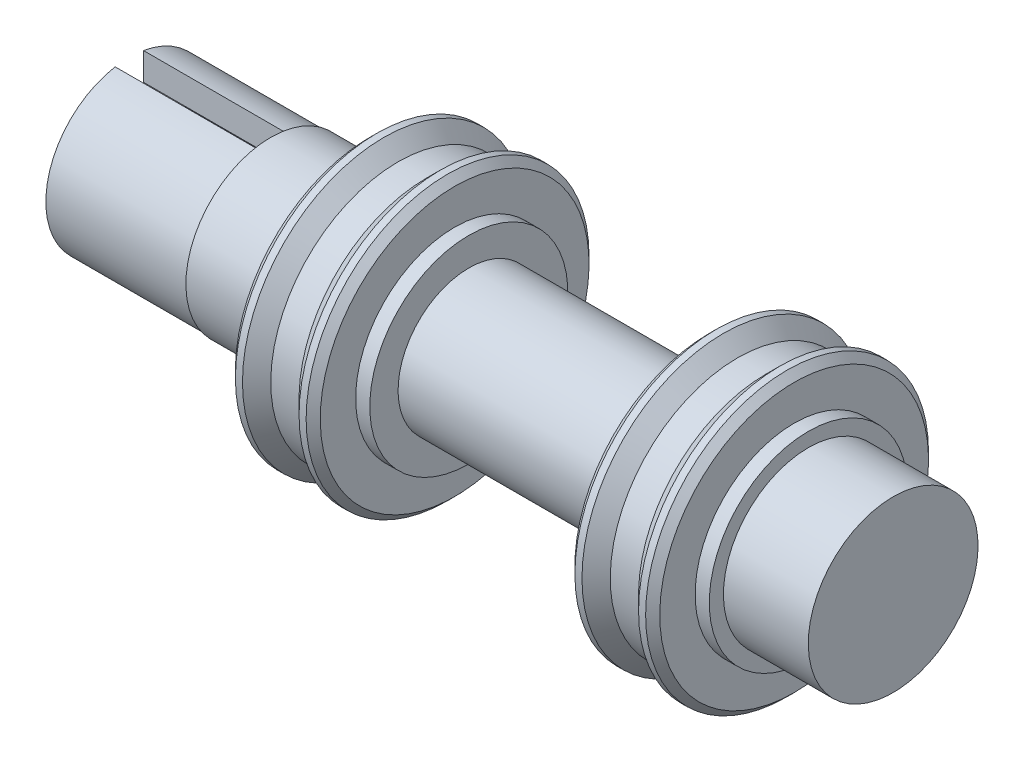
ISO-10303-21;
HEADER;
FILE_DESCRIPTION(('STEP AP214'),'2;1');
FILE_NAME('part.step','',(''),(''),'','','');
FILE_SCHEMA(('AUTOMOTIVE_DESIGN { 1 0 10303 214 1 1 1 1 }'));
ENDSEC;
DATA;
#1=APPLICATION_CONTEXT('core data for automotive mechanical design processes');
#2=APPLICATION_PROTOCOL_DEFINITION('international standard','automotive_design',2000,#1);
#3=PRODUCT_CONTEXT('',#1,'mechanical');
#4=PRODUCT('Part','Part','',(#3));
#5=PRODUCT_RELATED_PRODUCT_CATEGORY('part','',(#4));
#6=PRODUCT_DEFINITION_FORMATION('','',#4);
#7=PRODUCT_DEFINITION_CONTEXT('part definition',#1,'design');
#8=PRODUCT_DEFINITION('design','',#6,#7);
#9=PRODUCT_DEFINITION_SHAPE('','',#8);
#10=(LENGTH_UNIT() NAMED_UNIT(*) SI_UNIT(.MILLI.,.METRE.));
#11=(NAMED_UNIT(*) PLANE_ANGLE_UNIT() SI_UNIT($,.RADIAN.));
#12=(NAMED_UNIT(*) SI_UNIT($,.STERADIAN.) SOLID_ANGLE_UNIT());
#13=UNCERTAINTY_MEASURE_WITH_UNIT(LENGTH_MEASURE(1.E-05),#10,'distance_accuracy_value','');
#14=(GEOMETRIC_REPRESENTATION_CONTEXT(3) GLOBAL_UNCERTAINTY_ASSIGNED_CONTEXT((#13)) GLOBAL_UNIT_ASSIGNED_CONTEXT((#10,
#11,#12)) REPRESENTATION_CONTEXT('',''));
#15=CARTESIAN_POINT('',(0.,0.,0.));
#16=DIRECTION('',(0.,0.,1.));
#17=DIRECTION('',(1.,0.,0.));
#18=AXIS2_PLACEMENT_3D('',#15,#16,#17);
#19=CARTESIAN_POINT('',(-11.,3.,0.));
#20=DIRECTION('',(-1.,0.,0.));
#21=DIRECTION('',(0.,-1.,0.));
#22=AXIS2_PLACEMENT_3D('',#19,#20,#21);
#23=PLANE('',#22);
#24=DIRECTION('',(0.,1.,0.));
#25=VECTOR('',#24,1.);
#26=CARTESIAN_POINT('',(-11.,-1.93649167310371,-0.5));
#27=LINE('',#26,#25);
#28=CARTESIAN_POINT('',(-11.,-2.90731835202133,-0.5));
#29=VERTEX_POINT('',#28);
#30=CARTESIAN_POINT('',(-11.,-1.93649167310371,-0.5));
#31=VERTEX_POINT('',#30);
#32=EDGE_CURVE('E131',#29,#31,#27,.T.);
#33=ORIENTED_EDGE('',*,*,#32,.F.);
#34=CARTESIAN_POINT('',(-11.,0.,0.));
#35=DIRECTION('',(-1.,0.,0.));
#36=DIRECTION('',(0.,-1.,0.));
#37=AXIS2_PLACEMENT_3D('',#34,#35,#36);
#38=CIRCLE('',#37,2.95);
#39=CARTESIAN_POINT('',(-11.,2.90731835202132,-0.5));
#40=VERTEX_POINT('',#39);
#41=EDGE_CURVE('E128',#40,#29,#38,.T.);
#42=ORIENTED_EDGE('',*,*,#41,.F.);
#43=DIRECTION('',(0.,1.,0.));
#44=VECTOR('',#43,1.);
#45=CARTESIAN_POINT('',(-11.,2.90731835202132,-0.5));
#46=LINE('',#45,#44);
#47=CARTESIAN_POINT('',(-11.,1.93649167310371,-0.5));
#48=VERTEX_POINT('',#47);
#49=EDGE_CURVE('E140',#48,#40,#46,.T.);
#50=ORIENTED_EDGE('',*,*,#49,.F.);
#51=CARTESIAN_POINT('',(-11.,0.,0.));
#52=DIRECTION('',(1.,0.,0.));
#53=DIRECTION('',(0.,-1.,0.));
#54=AXIS2_PLACEMENT_3D('',#51,#52,#53);
#55=CIRCLE('',#54,2.);
#56=EDGE_CURVE('E148',#31,#48,#55,.T.);
#57=ORIENTED_EDGE('',*,*,#56,.F.);
#58=EDGE_LOOP('',(#33,#42,#50,#57));
#59=FACE_BOUND('',#58,.T.);
#60=CARTESIAN_POINT('',(-11.,0.,0.));
#61=DIRECTION('',(1.,0.,0.));
#62=DIRECTION('',(0.,1.,0.));
#63=AXIS2_PLACEMENT_3D('',#60,#61,#62);
#64=CIRCLE('',#63,3.);
#65=CARTESIAN_POINT('',(-11.,3.,0.));
#66=VERTEX_POINT('',#65);
#67=EDGE_CURVE('E207',#66,#66,#64,.T.);
#68=ORIENTED_EDGE('',*,*,#67,.F.);
#69=EDGE_LOOP('',(#68));
#70=FACE_BOUND('',#69,.T.);
#71=DIRECTION('',(0.,-1.,0.));
#72=VECTOR('',#71,1.);
#73=CARTESIAN_POINT('',(-11.,-1.93649167310371,0.500000000000001));
#74=LINE('',#73,#72);
#75=CARTESIAN_POINT('',(-11.,-1.93649167310371,0.500000000000001));
#76=VERTEX_POINT('',#75);
#77=CARTESIAN_POINT('',(-11.,-2.90731835202133,0.500000000000001));
#78=VERTEX_POINT('',#77);
#79=EDGE_CURVE('E646',#76,#78,#74,.T.);
#80=ORIENTED_EDGE('',*,*,#79,.F.);
#81=CARTESIAN_POINT('',(-11.,0.,0.));
#82=DIRECTION('',(1.,0.,0.));
#83=DIRECTION('',(0.,-1.,0.));
#84=AXIS2_PLACEMENT_3D('',#81,#82,#83);
#85=CIRCLE('',#84,2.);
#86=CARTESIAN_POINT('',(-11.,1.93649167310371,0.5));
#87=VERTEX_POINT('',#86);
#88=EDGE_CURVE('E126',#87,#76,#85,.T.);
#89=ORIENTED_EDGE('',*,*,#88,.F.);
#90=DIRECTION('',(0.,-1.,0.));
#91=VECTOR('',#90,1.);
#92=CARTESIAN_POINT('',(-11.,2.90731835202132,0.5));
#93=LINE('',#92,#91);
#94=CARTESIAN_POINT('',(-11.,2.90731835202132,0.5));
#95=VERTEX_POINT('',#94);
#96=EDGE_CURVE('E122',#95,#87,#93,.T.);
#97=ORIENTED_EDGE('',*,*,#96,.F.);
#98=CARTESIAN_POINT('',(-11.,0.,0.));
#99=DIRECTION('',(-1.,0.,0.));
#100=DIRECTION('',(0.,-1.,0.));
#101=AXIS2_PLACEMENT_3D('',#98,#99,#100);
#102=CIRCLE('',#101,2.95);
#103=EDGE_CURVE('E643',#78,#95,#102,.T.);
#104=ORIENTED_EDGE('',*,*,#103,.F.);
#105=EDGE_LOOP('',(#80,#89,#97,#104));
#106=FACE_BOUND('',#105,.T.);
#107=ADVANCED_FACE('F37',(#59,#70,#106),#23,.T.);
#108=CARTESIAN_POINT('',(-8.,3.,0.));
#109=DIRECTION('',(-1.,0.,0.));
#110=DIRECTION('',(0.,-1.,0.));
#111=AXIS2_PLACEMENT_3D('',#108,#109,#110);
#112=PLANE('',#111);
#113=CARTESIAN_POINT('',(-8.,0.,0.));
#114=DIRECTION('',(1.,0.,0.));
#115=DIRECTION('',(0.,1.,0.));
#116=AXIS2_PLACEMENT_3D('',#113,#114,#115);
#117=CIRCLE('',#116,3.);
#118=CARTESIAN_POINT('',(-8.,3.,0.));
#119=VERTEX_POINT('',#118);
#120=EDGE_CURVE('E204',#119,#119,#117,.T.);
#121=ORIENTED_EDGE('',*,*,#120,.T.);
#122=EDGE_LOOP('',(#121));
#123=FACE_BOUND('',#122,.T.);
#124=CARTESIAN_POINT('',(-8.,0.,0.));
#125=DIRECTION('',(1.,0.,0.));
#126=DIRECTION('',(0.,1.,0.));
#127=AXIS2_PLACEMENT_3D('',#124,#125,#126);
#128=CIRCLE('',#127,3.5);
#129=CARTESIAN_POINT('',(-8.,3.5,0.));
#130=VERTEX_POINT('',#129);
#131=EDGE_CURVE('E234',#130,#130,#128,.T.);
#132=ORIENTED_EDGE('',*,*,#131,.F.);
#133=EDGE_LOOP('',(#132));
#134=FACE_BOUND('',#133,.T.);
#135=ADVANCED_FACE('F263',(#123,#134),#112,.T.);
#136=CARTESIAN_POINT('',(-5.51877622836158,0.,0.));
#137=DIRECTION('',(1.,0.,0.));
#138=DIRECTION('',(0.,1.,0.));
#139=AXIS2_PLACEMENT_3D('',#136,#137,#138);
#140=CYLINDRICAL_SURFACE('',#139,3.5);
#141=ORIENTED_EDGE('',*,*,#131,.T.);
#142=EDGE_LOOP('',(#141));
#143=FACE_BOUND('',#142,.T.);
#144=CARTESIAN_POINT('',(-7.5,0.,0.));
#145=DIRECTION('',(1.,0.,0.));
#146=DIRECTION('',(0.,1.,0.));
#147=AXIS2_PLACEMENT_3D('',#144,#145,#146);
#148=CIRCLE('',#147,3.5);
#149=CARTESIAN_POINT('',(-7.5,3.5,0.));
#150=VERTEX_POINT('',#149);
#151=EDGE_CURVE('E231',#150,#150,#148,.T.);
#152=ORIENTED_EDGE('',*,*,#151,.F.);
#153=EDGE_LOOP('',(#152));
#154=FACE_BOUND('',#153,.T.);
#155=ADVANCED_FACE('F271',(#143,#154),#140,.T.);
#156=CARTESIAN_POINT('',(-7.5,3.5,0.));
#157=DIRECTION('',(-1.,0.,0.));
#158=DIRECTION('',(0.,-1.,0.));
#159=AXIS2_PLACEMENT_3D('',#156,#157,#158);
#160=PLANE('',#159);
#161=CARTESIAN_POINT('',(-7.5,0.,0.));
#162=DIRECTION('',(-1.,0.,0.));
#163=DIRECTION('',(0.,-1.,0.));
#164=AXIS2_PLACEMENT_3D('',#161,#162,#163);
#165=CIRCLE('',#164,4.75);
#166=CARTESIAN_POINT('',(-7.5,-4.75,0.));
#167=VERTEX_POINT('',#166);
#168=EDGE_CURVE('E11',#167,#167,#165,.T.);
#169=ORIENTED_EDGE('',*,*,#168,.T.);
#170=EDGE_LOOP('',(#169));
#171=FACE_BOUND('',#170,.T.);
#172=ORIENTED_EDGE('',*,*,#151,.T.);
#173=EDGE_LOOP('',(#172));
#174=FACE_BOUND('',#173,.T.);
#175=ADVANCED_FACE('F313',(#171,#174),#160,.T.);
#176=CARTESIAN_POINT('',(-5.51877622836158,0.,0.));
#177=DIRECTION('',(1.,0.,0.));
#178=DIRECTION('',(0.,1.,0.));
#179=AXIS2_PLACEMENT_3D('',#176,#177,#178);
#180=CYLINDRICAL_SURFACE('',#179,5.);
#181=CARTESIAN_POINT('',(-7.25,0.,0.));
#182=DIRECTION('',(-1.,0.,0.));
#183=DIRECTION('',(0.,-1.,0.));
#184=AXIS2_PLACEMENT_3D('',#181,#182,#183);
#185=CIRCLE('',#184,5.);
#186=CARTESIAN_POINT('',(-7.25,-5.,0.));
#187=VERTEX_POINT('',#186);
#188=EDGE_CURVE('E45',#187,#187,#185,.F.);
#189=ORIENTED_EDGE('',*,*,#188,.T.);
#190=EDGE_LOOP('',(#189));
#191=FACE_BOUND('',#190,.T.);
#192=CARTESIAN_POINT('',(-7.,0.,0.));
#193=DIRECTION('',(1.,0.,0.));
#194=DIRECTION('',(0.,1.,0.));
#195=AXIS2_PLACEMENT_3D('',#192,#193,#194);
#196=CIRCLE('',#195,5.);
#197=CARTESIAN_POINT('',(-7.,5.,0.));
#198=VERTEX_POINT('',#197);
#199=EDGE_CURVE('E228',#198,#198,#196,.T.);
#200=ORIENTED_EDGE('',*,*,#199,.F.);
#201=EDGE_LOOP('',(#200));
#202=FACE_BOUND('',#201,.T.);
#203=ADVANCED_FACE('F245',(#191,#202),#180,.T.);
#204=CARTESIAN_POINT('',(-6.5,0.,0.));
#205=DIRECTION('',(-1.,0.,0.));
#206=DIRECTION('',(0.,-1.,0.));
#207=AXIS2_PLACEMENT_3D('',#204,#205,#206);
#208=CONICAL_SURFACE('',#207,4.5,0.785398163397448);
#209=ORIENTED_EDGE('',*,*,#199,.T.);
#210=EDGE_LOOP('',(#209));
#211=FACE_BOUND('',#210,.T.);
#212=CARTESIAN_POINT('',(-6.5,0.,0.));
#213=DIRECTION('',(1.,0.,0.));
#214=DIRECTION('',(0.,1.,0.));
#215=AXIS2_PLACEMENT_3D('',#212,#213,#214);
#216=CIRCLE('',#215,4.5);
#217=CARTESIAN_POINT('',(-6.5,4.5,0.));
#218=VERTEX_POINT('',#217);
#219=EDGE_CURVE('E225',#218,#218,#216,.T.);
#220=ORIENTED_EDGE('',*,*,#219,.F.);
#221=EDGE_LOOP('',(#220));
#222=FACE_BOUND('',#221,.T.);
#223=ADVANCED_FACE('F306',(#211,#222),#208,.T.);
#224=CARTESIAN_POINT('',(-5.51877622836158,0.,0.));
#225=DIRECTION('',(1.,0.,0.));
#226=DIRECTION('',(0.,1.,0.));
#227=AXIS2_PLACEMENT_3D('',#224,#225,#226);
#228=CYLINDRICAL_SURFACE('',#227,4.5);
#229=ORIENTED_EDGE('',*,*,#219,.T.);
#230=EDGE_LOOP('',(#229));
#231=FACE_BOUND('',#230,.T.);
#232=CARTESIAN_POINT('',(-5.5,0.,0.));
#233=DIRECTION('',(1.,0.,0.));
#234=DIRECTION('',(0.,1.,0.));
#235=AXIS2_PLACEMENT_3D('',#232,#233,#234);
#236=CIRCLE('',#235,4.5);
#237=CARTESIAN_POINT('',(-5.5,4.5,0.));
#238=VERTEX_POINT('',#237);
#239=EDGE_CURVE('E222',#238,#238,#236,.T.);
#240=ORIENTED_EDGE('',*,*,#239,.F.);
#241=EDGE_LOOP('',(#240));
#242=FACE_BOUND('',#241,.T.);
#243=ADVANCED_FACE('F302',(#231,#242),#228,.T.);
#244=CARTESIAN_POINT('',(-5.,0.,0.));
#245=DIRECTION('',(1.,0.,0.));
#246=DIRECTION('',(0.,1.,0.));
#247=AXIS2_PLACEMENT_3D('',#244,#245,#246);
#248=CONICAL_SURFACE('',#247,5.,0.785398163397448);
#249=ORIENTED_EDGE('',*,*,#239,.T.);
#250=EDGE_LOOP('',(#249));
#251=FACE_BOUND('',#250,.T.);
#252=CARTESIAN_POINT('',(-5.,0.,0.));
#253=DIRECTION('',(1.,0.,0.));
#254=DIRECTION('',(0.,1.,0.));
#255=AXIS2_PLACEMENT_3D('',#252,#253,#254);
#256=CIRCLE('',#255,5.);
#257=CARTESIAN_POINT('',(-5.,5.,0.));
#258=VERTEX_POINT('',#257);
#259=EDGE_CURVE('E219',#258,#258,#256,.T.);
#260=ORIENTED_EDGE('',*,*,#259,.F.);
#261=EDGE_LOOP('',(#260));
#262=FACE_BOUND('',#261,.T.);
#263=ADVANCED_FACE('F298',(#251,#262),#248,.T.);
#264=CARTESIAN_POINT('',(-5.51877622836158,0.,0.));
#265=DIRECTION('',(1.,0.,0.));
#266=DIRECTION('',(0.,1.,0.));
#267=AXIS2_PLACEMENT_3D('',#264,#265,#266);
#268=CYLINDRICAL_SURFACE('',#267,5.);
#269=CARTESIAN_POINT('',(-4.75,0.,0.));
#270=DIRECTION('',(1.,0.,0.));
#271=DIRECTION('',(0.,1.,0.));
#272=AXIS2_PLACEMENT_3D('',#269,#270,#271);
#273=CIRCLE('',#272,5.);
#274=CARTESIAN_POINT('',(-4.75,5.,0.));
#275=VERTEX_POINT('',#274);
#276=EDGE_CURVE('E240',#275,#275,#273,.F.);
#277=ORIENTED_EDGE('',*,*,#276,.T.);
#278=EDGE_LOOP('',(#277));
#279=FACE_BOUND('',#278,.T.);
#280=ORIENTED_EDGE('',*,*,#259,.T.);
#281=EDGE_LOOP('',(#280));
#282=FACE_BOUND('',#281,.T.);
#283=ADVANCED_FACE('F294',(#279,#282),#268,.T.);
#284=CARTESIAN_POINT('',(-4.5,3.5,0.));
#285=DIRECTION('',(1.,0.,0.));
#286=DIRECTION('',(0.,1.,0.));
#287=AXIS2_PLACEMENT_3D('',#284,#285,#286);
#288=PLANE('',#287);
#289=CARTESIAN_POINT('',(-4.5,0.,0.));
#290=DIRECTION('',(1.,0.,0.));
#291=DIRECTION('',(0.,1.,0.));
#292=AXIS2_PLACEMENT_3D('',#289,#290,#291);
#293=CIRCLE('',#292,4.75);
#294=CARTESIAN_POINT('',(-4.5,4.75,0.));
#295=VERTEX_POINT('',#294);
#296=EDGE_CURVE('E237',#295,#295,#293,.T.);
#297=ORIENTED_EDGE('',*,*,#296,.T.);
#298=EDGE_LOOP('',(#297));
#299=FACE_BOUND('',#298,.T.);
#300=CARTESIAN_POINT('',(-4.5,0.,0.));
#301=DIRECTION('',(1.,0.,0.));
#302=DIRECTION('',(0.,1.,0.));
#303=AXIS2_PLACEMENT_3D('',#300,#301,#302);
#304=CIRCLE('',#303,3.5);
#305=CARTESIAN_POINT('',(-4.5,3.5,0.));
#306=VERTEX_POINT('',#305);
#307=EDGE_CURVE('E216',#306,#306,#304,.T.);
#308=ORIENTED_EDGE('',*,*,#307,.F.);
#309=EDGE_LOOP('',(#308));
#310=FACE_BOUND('',#309,.T.);
#311=ADVANCED_FACE('F290',(#299,#310),#288,.T.);
#312=CARTESIAN_POINT('',(-5.51877622836158,0.,0.));
#313=DIRECTION('',(1.,0.,0.));
#314=DIRECTION('',(0.,1.,0.));
#315=AXIS2_PLACEMENT_3D('',#312,#313,#314);
#316=CYLINDRICAL_SURFACE('',#315,3.5);
#317=ORIENTED_EDGE('',*,*,#307,.T.);
#318=EDGE_LOOP('',(#317));
#319=FACE_BOUND('',#318,.T.);
#320=CARTESIAN_POINT('',(-4.,0.,0.));
#321=DIRECTION('',(1.,0.,0.));
#322=DIRECTION('',(0.,1.,0.));
#323=AXIS2_PLACEMENT_3D('',#320,#321,#322);
#324=CIRCLE('',#323,3.5);
#325=CARTESIAN_POINT('',(-4.,3.5,0.));
#326=VERTEX_POINT('',#325);
#327=EDGE_CURVE('E213',#326,#326,#324,.T.);
#328=ORIENTED_EDGE('',*,*,#327,.F.);
#329=EDGE_LOOP('',(#328));
#330=FACE_BOUND('',#329,.T.);
#331=ADVANCED_FACE('F286',(#319,#330),#316,.T.);
#332=CARTESIAN_POINT('',(-4.,2.5,0.));
#333=DIRECTION('',(1.,0.,0.));
#334=DIRECTION('',(0.,1.,0.));
#335=AXIS2_PLACEMENT_3D('',#332,#333,#334);
#336=PLANE('',#335);
#337=ORIENTED_EDGE('',*,*,#327,.T.);
#338=EDGE_LOOP('',(#337));
#339=FACE_BOUND('',#338,.T.);
#340=CARTESIAN_POINT('',(-4.,0.,0.));
#341=DIRECTION('',(1.,0.,0.));
#342=DIRECTION('',(0.,1.,0.));
#343=AXIS2_PLACEMENT_3D('',#340,#341,#342);
#344=CIRCLE('',#343,2.5);
#345=CARTESIAN_POINT('',(-4.,2.5,0.));
#346=VERTEX_POINT('',#345);
#347=EDGE_CURVE('E210',#346,#346,#344,.T.);
#348=ORIENTED_EDGE('',*,*,#347,.F.);
#349=EDGE_LOOP('',(#348));
#350=FACE_BOUND('',#349,.T.);
#351=ADVANCED_FACE('F282',(#339,#350),#336,.T.);
#352=CARTESIAN_POINT('',(-5.51877622836158,0.,0.));
#353=DIRECTION('',(1.,0.,0.));
#354=DIRECTION('',(0.,1.,0.));
#355=AXIS2_PLACEMENT_3D('',#352,#353,#354);
#356=CYLINDRICAL_SURFACE('',#355,2.5);
#357=ORIENTED_EDGE('',*,*,#347,.T.);
#358=EDGE_LOOP('',(#357));
#359=FACE_BOUND('',#358,.T.);
#360=CARTESIAN_POINT('',(4.,0.,0.));
#361=DIRECTION('',(1.,0.,0.));
#362=DIRECTION('',(0.,1.,0.));
#363=AXIS2_PLACEMENT_3D('',#360,#361,#362);
#364=CIRCLE('',#363,2.5);
#365=CARTESIAN_POINT('',(4.,2.5,0.));
#366=VERTEX_POINT('',#365);
#367=EDGE_CURVE('E165',#366,#366,#364,.T.);
#368=ORIENTED_EDGE('',*,*,#367,.F.);
#369=EDGE_LOOP('',(#368));
#370=FACE_BOUND('',#369,.T.);
#371=ADVANCED_FACE('F279',(#359,#370),#356,.T.);
#372=CARTESIAN_POINT('',(-5.51877622836158,0.,0.));
#373=DIRECTION('',(1.,0.,0.));
#374=DIRECTION('',(0.,1.,0.));
#375=AXIS2_PLACEMENT_3D('',#372,#373,#374);
#376=CYLINDRICAL_SURFACE('',#375,3.);
#377=ORIENTED_EDGE('',*,*,#67,.T.);
#378=EDGE_LOOP('',(#377));
#379=FACE_BOUND('',#378,.T.);
#380=ORIENTED_EDGE('',*,*,#120,.F.);
#381=EDGE_LOOP('',(#380));
#382=FACE_BOUND('',#381,.T.);
#383=ADVANCED_FACE('F259',(#379,#382),#376,.T.);
#384=CARTESIAN_POINT('',(-4.5,0.,0.));
#385=DIRECTION('',(-1.,0.,0.));
#386=DIRECTION('',(0.,-1.,0.));
#387=AXIS2_PLACEMENT_3D('',#384,#385,#386);
#388=CONICAL_SURFACE('',#387,4.75,0.785398163397452);
#389=ORIENTED_EDGE('',*,*,#276,.F.);
#390=EDGE_LOOP('',(#389));
#391=FACE_BOUND('',#390,.T.);
#392=ORIENTED_EDGE('',*,*,#296,.F.);
#393=EDGE_LOOP('',(#392));
#394=FACE_BOUND('',#393,.T.);
#395=ADVANCED_FACE('F250',(#391,#394),#388,.T.);
#396=CARTESIAN_POINT('',(-7.25,0.,0.));
#397=DIRECTION('',(1.,0.,0.));
#398=DIRECTION('',(0.,1.,0.));
#399=AXIS2_PLACEMENT_3D('',#396,#397,#398);
#400=CONICAL_SURFACE('',#399,5.,0.785398163397452);
#401=ORIENTED_EDGE('',*,*,#168,.F.);
#402=EDGE_LOOP('',(#401));
#403=FACE_BOUND('',#402,.T.);
#404=ORIENTED_EDGE('',*,*,#188,.F.);
#405=EDGE_LOOP('',(#404));
#406=FACE_BOUND('',#405,.T.);
#407=ADVANCED_FACE('F39',(#403,#406),#400,.T.);
#408=CARTESIAN_POINT('',(8.,3.,0.));
#409=DIRECTION('',(1.,0.,0.));
#410=DIRECTION('',(0.,-1.,0.));
#411=AXIS2_PLACEMENT_3D('',#408,#409,#410);
#412=PLANE('',#411);
#413=CARTESIAN_POINT('',(8.,0.,0.));
#414=DIRECTION('',(1.,0.,0.));
#415=DIRECTION('',(0.,1.,0.));
#416=AXIS2_PLACEMENT_3D('',#413,#414,#415);
#417=CIRCLE('',#416,3.);
#418=CARTESIAN_POINT('',(8.,3.,0.));
#419=VERTEX_POINT('',#418);
#420=EDGE_CURVE('E159',#419,#419,#417,.T.);
#421=ORIENTED_EDGE('',*,*,#420,.F.);
#422=EDGE_LOOP('',(#421));
#423=FACE_BOUND('',#422,.T.);
#424=CARTESIAN_POINT('',(8.,0.,0.));
#425=DIRECTION('',(1.,0.,0.));
#426=DIRECTION('',(0.,1.,0.));
#427=AXIS2_PLACEMENT_3D('',#424,#425,#426);
#428=CIRCLE('',#427,3.5);
#429=CARTESIAN_POINT('',(8.,3.5,0.));
#430=VERTEX_POINT('',#429);
#431=EDGE_CURVE('E189',#430,#430,#428,.T.);
#432=ORIENTED_EDGE('',*,*,#431,.T.);
#433=EDGE_LOOP('',(#432));
#434=FACE_BOUND('',#433,.T.);
#435=ADVANCED_FACE('F249',(#423,#434),#412,.T.);
#436=CARTESIAN_POINT('',(5.51877622836158,0.,0.));
#437=DIRECTION('',(-1.,0.,0.));
#438=DIRECTION('',(0.,1.,0.));
#439=AXIS2_PLACEMENT_3D('',#436,#437,#438);
#440=CYLINDRICAL_SURFACE('',#439,3.5);
#441=ORIENTED_EDGE('',*,*,#431,.F.);
#442=EDGE_LOOP('',(#441));
#443=FACE_BOUND('',#442,.T.);
#444=CARTESIAN_POINT('',(7.5,0.,0.));
#445=DIRECTION('',(1.,0.,0.));
#446=DIRECTION('',(0.,1.,0.));
#447=AXIS2_PLACEMENT_3D('',#444,#445,#446);
#448=CIRCLE('',#447,3.5);
#449=CARTESIAN_POINT('',(7.5,3.5,0.));
#450=VERTEX_POINT('',#449);
#451=EDGE_CURVE('E186',#450,#450,#448,.T.);
#452=ORIENTED_EDGE('',*,*,#451,.T.);
#453=EDGE_LOOP('',(#452));
#454=FACE_BOUND('',#453,.T.);
#455=ADVANCED_FACE('F256',(#443,#454),#440,.T.);
#456=CARTESIAN_POINT('',(7.5,3.5,0.));
#457=DIRECTION('',(1.,0.,0.));
#458=DIRECTION('',(0.,-1.,0.));
#459=AXIS2_PLACEMENT_3D('',#456,#457,#458);
#460=PLANE('',#459);
#461=CARTESIAN_POINT('',(7.5,0.,0.));
#462=DIRECTION('',(-1.,0.,0.));
#463=DIRECTION('',(0.,-1.,0.));
#464=AXIS2_PLACEMENT_3D('',#461,#462,#463);
#465=CIRCLE('',#464,4.75);
#466=CARTESIAN_POINT('',(7.5,-4.75,0.));
#467=VERTEX_POINT('',#466);
#468=EDGE_CURVE('E201',#467,#467,#465,.T.);
#469=ORIENTED_EDGE('',*,*,#468,.F.);
#470=EDGE_LOOP('',(#469));
#471=FACE_BOUND('',#470,.T.);
#472=ORIENTED_EDGE('',*,*,#451,.F.);
#473=EDGE_LOOP('',(#472));
#474=FACE_BOUND('',#473,.T.);
#475=ADVANCED_FACE('F427',(#471,#474),#460,.T.);
#476=CARTESIAN_POINT('',(5.51877622836158,0.,0.));
#477=DIRECTION('',(-1.,0.,0.));
#478=DIRECTION('',(0.,1.,0.));
#479=AXIS2_PLACEMENT_3D('',#476,#477,#478);
#480=CYLINDRICAL_SURFACE('',#479,5.);
#481=CARTESIAN_POINT('',(7.25,0.,0.));
#482=DIRECTION('',(-1.,0.,0.));
#483=DIRECTION('',(0.,-1.,0.));
#484=AXIS2_PLACEMENT_3D('',#481,#482,#483);
#485=CIRCLE('',#484,5.);
#486=CARTESIAN_POINT('',(7.25,-5.,0.));
#487=VERTEX_POINT('',#486);
#488=EDGE_CURVE('E198',#487,#487,#485,.F.);
#489=ORIENTED_EDGE('',*,*,#488,.F.);
#490=EDGE_LOOP('',(#489));
#491=FACE_BOUND('',#490,.T.);
#492=CARTESIAN_POINT('',(7.,0.,0.));
#493=DIRECTION('',(1.,0.,0.));
#494=DIRECTION('',(0.,1.,0.));
#495=AXIS2_PLACEMENT_3D('',#492,#493,#494);
#496=CIRCLE('',#495,5.);
#497=CARTESIAN_POINT('',(7.,5.,0.));
#498=VERTEX_POINT('',#497);
#499=EDGE_CURVE('E183',#498,#498,#496,.T.);
#500=ORIENTED_EDGE('',*,*,#499,.T.);
#501=EDGE_LOOP('',(#500));
#502=FACE_BOUND('',#501,.T.);
#503=ADVANCED_FACE('F436',(#491,#502),#480,.T.);
#504=CARTESIAN_POINT('',(6.5,0.,0.));
#505=DIRECTION('',(1.,0.,0.));
#506=DIRECTION('',(0.,-1.,0.));
#507=AXIS2_PLACEMENT_3D('',#504,#505,#506);
#508=CONICAL_SURFACE('',#507,4.5,0.785398163397448);
#509=ORIENTED_EDGE('',*,*,#499,.F.);
#510=EDGE_LOOP('',(#509));
#511=FACE_BOUND('',#510,.T.);
#512=CARTESIAN_POINT('',(6.5,0.,0.));
#513=DIRECTION('',(1.,0.,0.));
#514=DIRECTION('',(0.,1.,0.));
#515=AXIS2_PLACEMENT_3D('',#512,#513,#514);
#516=CIRCLE('',#515,4.5);
#517=CARTESIAN_POINT('',(6.5,4.5,0.));
#518=VERTEX_POINT('',#517);
#519=EDGE_CURVE('E180',#518,#518,#516,.T.);
#520=ORIENTED_EDGE('',*,*,#519,.T.);
#521=EDGE_LOOP('',(#520));
#522=FACE_BOUND('',#521,.T.);
#523=ADVANCED_FACE('F445',(#511,#522),#508,.T.);
#524=CARTESIAN_POINT('',(5.51877622836158,0.,0.));
#525=DIRECTION('',(-1.,0.,0.));
#526=DIRECTION('',(0.,1.,0.));
#527=AXIS2_PLACEMENT_3D('',#524,#525,#526);
#528=CYLINDRICAL_SURFACE('',#527,4.5);
#529=ORIENTED_EDGE('',*,*,#519,.F.);
#530=EDGE_LOOP('',(#529));
#531=FACE_BOUND('',#530,.T.);
#532=CARTESIAN_POINT('',(5.5,0.,0.));
#533=DIRECTION('',(1.,0.,0.));
#534=DIRECTION('',(0.,1.,0.));
#535=AXIS2_PLACEMENT_3D('',#532,#533,#534);
#536=CIRCLE('',#535,4.5);
#537=CARTESIAN_POINT('',(5.5,4.5,0.));
#538=VERTEX_POINT('',#537);
#539=EDGE_CURVE('E177',#538,#538,#536,.T.);
#540=ORIENTED_EDGE('',*,*,#539,.T.);
#541=EDGE_LOOP('',(#540));
#542=FACE_BOUND('',#541,.T.);
#543=ADVANCED_FACE('F454',(#531,#542),#528,.T.);
#544=CARTESIAN_POINT('',(5.,0.,0.));
#545=DIRECTION('',(-1.,0.,0.));
#546=DIRECTION('',(0.,1.,0.));
#547=AXIS2_PLACEMENT_3D('',#544,#545,#546);
#548=CONICAL_SURFACE('',#547,5.,0.785398163397448);
#549=ORIENTED_EDGE('',*,*,#539,.F.);
#550=EDGE_LOOP('',(#549));
#551=FACE_BOUND('',#550,.T.);
#552=CARTESIAN_POINT('',(5.,0.,0.));
#553=DIRECTION('',(1.,0.,0.));
#554=DIRECTION('',(0.,1.,0.));
#555=AXIS2_PLACEMENT_3D('',#552,#553,#554);
#556=CIRCLE('',#555,5.);
#557=CARTESIAN_POINT('',(5.,5.,0.));
#558=VERTEX_POINT('',#557);
#559=EDGE_CURVE('E174',#558,#558,#556,.T.);
#560=ORIENTED_EDGE('',*,*,#559,.T.);
#561=EDGE_LOOP('',(#560));
#562=FACE_BOUND('',#561,.T.);
#563=ADVANCED_FACE('F463',(#551,#562),#548,.T.);
#564=CARTESIAN_POINT('',(5.51877622836158,0.,0.));
#565=DIRECTION('',(-1.,0.,0.));
#566=DIRECTION('',(0.,1.,0.));
#567=AXIS2_PLACEMENT_3D('',#564,#565,#566);
#568=CYLINDRICAL_SURFACE('',#567,5.);
#569=CARTESIAN_POINT('',(4.75,0.,0.));
#570=DIRECTION('',(1.,0.,0.));
#571=DIRECTION('',(0.,1.,0.));
#572=AXIS2_PLACEMENT_3D('',#569,#570,#571);
#573=CIRCLE('',#572,5.);
#574=CARTESIAN_POINT('',(4.75,5.,0.));
#575=VERTEX_POINT('',#574);
#576=EDGE_CURVE('E195',#575,#575,#573,.F.);
#577=ORIENTED_EDGE('',*,*,#576,.F.);
#578=EDGE_LOOP('',(#577));
#579=FACE_BOUND('',#578,.T.);
#580=ORIENTED_EDGE('',*,*,#559,.F.);
#581=EDGE_LOOP('',(#580));
#582=FACE_BOUND('',#581,.T.);
#583=ADVANCED_FACE('F472',(#579,#582),#568,.T.);
#584=CARTESIAN_POINT('',(4.5,3.5,0.));
#585=DIRECTION('',(-1.,0.,0.));
#586=DIRECTION('',(0.,1.,0.));
#587=AXIS2_PLACEMENT_3D('',#584,#585,#586);
#588=PLANE('',#587);
#589=CARTESIAN_POINT('',(4.5,0.,0.));
#590=DIRECTION('',(1.,0.,0.));
#591=DIRECTION('',(0.,1.,0.));
#592=AXIS2_PLACEMENT_3D('',#589,#590,#591);
#593=CIRCLE('',#592,4.75);
#594=CARTESIAN_POINT('',(4.5,4.75,0.));
#595=VERTEX_POINT('',#594);
#596=EDGE_CURVE('E192',#595,#595,#593,.T.);
#597=ORIENTED_EDGE('',*,*,#596,.F.);
#598=EDGE_LOOP('',(#597));
#599=FACE_BOUND('',#598,.T.);
#600=CARTESIAN_POINT('',(4.5,0.,0.));
#601=DIRECTION('',(1.,0.,0.));
#602=DIRECTION('',(0.,1.,0.));
#603=AXIS2_PLACEMENT_3D('',#600,#601,#602);
#604=CIRCLE('',#603,3.5);
#605=CARTESIAN_POINT('',(4.5,3.5,0.));
#606=VERTEX_POINT('',#605);
#607=EDGE_CURVE('E171',#606,#606,#604,.T.);
#608=ORIENTED_EDGE('',*,*,#607,.T.);
#609=EDGE_LOOP('',(#608));
#610=FACE_BOUND('',#609,.T.);
#611=ADVANCED_FACE('F481',(#599,#610),#588,.T.);
#612=CARTESIAN_POINT('',(5.51877622836158,0.,0.));
#613=DIRECTION('',(-1.,0.,0.));
#614=DIRECTION('',(0.,1.,0.));
#615=AXIS2_PLACEMENT_3D('',#612,#613,#614);
#616=CYLINDRICAL_SURFACE('',#615,3.5);
#617=ORIENTED_EDGE('',*,*,#607,.F.);
#618=EDGE_LOOP('',(#617));
#619=FACE_BOUND('',#618,.T.);
#620=CARTESIAN_POINT('',(4.,0.,0.));
#621=DIRECTION('',(1.,0.,0.));
#622=DIRECTION('',(0.,1.,0.));
#623=AXIS2_PLACEMENT_3D('',#620,#621,#622);
#624=CIRCLE('',#623,3.5);
#625=CARTESIAN_POINT('',(4.,3.5,0.));
#626=VERTEX_POINT('',#625);
#627=EDGE_CURVE('E168',#626,#626,#624,.T.);
#628=ORIENTED_EDGE('',*,*,#627,.T.);
#629=EDGE_LOOP('',(#628));
#630=FACE_BOUND('',#629,.T.);
#631=ADVANCED_FACE('F490',(#619,#630),#616,.T.);
#632=CARTESIAN_POINT('',(4.,2.5,0.));
#633=DIRECTION('',(-1.,0.,0.));
#634=DIRECTION('',(0.,1.,0.));
#635=AXIS2_PLACEMENT_3D('',#632,#633,#634);
#636=PLANE('',#635);
#637=ORIENTED_EDGE('',*,*,#627,.F.);
#638=EDGE_LOOP('',(#637));
#639=FACE_BOUND('',#638,.T.);
#640=ORIENTED_EDGE('',*,*,#367,.T.);
#641=EDGE_LOOP('',(#640));
#642=FACE_BOUND('',#641,.T.);
#643=ADVANCED_FACE('F499',(#639,#642),#636,.T.);
#644=CARTESIAN_POINT('',(11.,3.,0.));
#645=DIRECTION('',(1.,0.,0.));
#646=DIRECTION('',(0.,-1.,0.));
#647=AXIS2_PLACEMENT_3D('',#644,#645,#646);
#648=PLANE('',#647);
#649=CARTESIAN_POINT('',(11.,0.,0.));
#650=DIRECTION('',(1.,0.,0.));
#651=DIRECTION('',(0.,1.,0.));
#652=AXIS2_PLACEMENT_3D('',#649,#650,#651);
#653=CIRCLE('',#652,3.);
#654=CARTESIAN_POINT('',(11.,3.,0.));
#655=VERTEX_POINT('',#654);
#656=EDGE_CURVE('E162',#655,#655,#653,.T.);
#657=ORIENTED_EDGE('',*,*,#656,.T.);
#658=EDGE_LOOP('',(#657));
#659=FACE_BOUND('',#658,.T.);
#660=ADVANCED_FACE('F508',(#659),#648,.T.);
#661=CARTESIAN_POINT('',(5.51877622836158,0.,0.));
#662=DIRECTION('',(-1.,0.,0.));
#663=DIRECTION('',(0.,1.,0.));
#664=AXIS2_PLACEMENT_3D('',#661,#662,#663);
#665=CYLINDRICAL_SURFACE('',#664,3.);
#666=ORIENTED_EDGE('',*,*,#656,.F.);
#667=EDGE_LOOP('',(#666));
#668=FACE_BOUND('',#667,.T.);
#669=ORIENTED_EDGE('',*,*,#420,.T.);
#670=EDGE_LOOP('',(#669));
#671=FACE_BOUND('',#670,.T.);
#672=ADVANCED_FACE('F517',(#668,#671),#665,.T.);
#673=CARTESIAN_POINT('',(4.5,0.,0.));
#674=DIRECTION('',(1.,0.,0.));
#675=DIRECTION('',(0.,-1.,0.));
#676=AXIS2_PLACEMENT_3D('',#673,#674,#675);
#677=CONICAL_SURFACE('',#676,4.75,0.785398163397452);
#678=ORIENTED_EDGE('',*,*,#576,.T.);
#679=EDGE_LOOP('',(#678));
#680=FACE_BOUND('',#679,.T.);
#681=ORIENTED_EDGE('',*,*,#596,.T.);
#682=EDGE_LOOP('',(#681));
#683=FACE_BOUND('',#682,.T.);
#684=ADVANCED_FACE('F526',(#680,#683),#677,.T.);
#685=CARTESIAN_POINT('',(7.25,0.,0.));
#686=DIRECTION('',(-1.,0.,0.));
#687=DIRECTION('',(0.,1.,0.));
#688=AXIS2_PLACEMENT_3D('',#685,#686,#687);
#689=CONICAL_SURFACE('',#688,5.,0.785398163397452);
#690=ORIENTED_EDGE('',*,*,#468,.T.);
#691=EDGE_LOOP('',(#690));
#692=FACE_BOUND('',#691,.T.);
#693=ORIENTED_EDGE('',*,*,#488,.T.);
#694=EDGE_LOOP('',(#693));
#695=FACE_BOUND('',#694,.T.);
#696=ADVANCED_FACE('F535',(#692,#695),#689,.T.);
#697=CARTESIAN_POINT('',(-16.,0.,0.));
#698=DIRECTION('',(1.,0.,0.));
#699=DIRECTION('',(0.,1.,0.));
#700=AXIS2_PLACEMENT_3D('',#697,#698,#699);
#701=CYLINDRICAL_SURFACE('',#700,2.95);
#702=ORIENTED_EDGE('',*,*,#41,.T.);
#703=DIRECTION('',(1.,0.,0.));
#704=VECTOR('',#703,1.);
#705=CARTESIAN_POINT('',(-16.,-2.90731835202133,-0.5));
#706=LINE('',#705,#704);
#707=CARTESIAN_POINT('',(-16.,-2.90731835202133,-0.5));
#708=VERTEX_POINT('',#707);
#709=EDGE_CURVE('E157',#708,#29,#706,.T.);
#710=ORIENTED_EDGE('',*,*,#709,.F.);
#711=CARTESIAN_POINT('',(-16.,0.,0.));
#712=DIRECTION('',(-1.,0.,0.));
#713=DIRECTION('',(0.,-1.,0.));
#714=AXIS2_PLACEMENT_3D('',#711,#712,#713);
#715=CIRCLE('',#714,2.95);
#716=CARTESIAN_POINT('',(-16.,2.90731835202132,-0.5));
#717=VERTEX_POINT('',#716);
#718=EDGE_CURVE('E136',#717,#708,#715,.T.);
#719=ORIENTED_EDGE('',*,*,#718,.F.);
#720=DIRECTION('',(1.,0.,0.));
#721=VECTOR('',#720,1.);
#722=CARTESIAN_POINT('',(-16.,2.90731835202132,-0.5));
#723=LINE('',#722,#721);
#724=EDGE_CURVE('E145',#717,#40,#723,.T.);
#725=ORIENTED_EDGE('',*,*,#724,.T.);
#726=EDGE_LOOP('',(#702,#710,#719,#725));
#727=FACE_BOUND('',#726,.T.);
#728=ADVANCED_FACE('F543',(#727),#701,.T.);
#729=CARTESIAN_POINT('',(-16.,-1.93649167310371,-0.5));
#730=DIRECTION('',(0.,0.,-1.));
#731=DIRECTION('',(0.,1.,0.));
#732=AXIS2_PLACEMENT_3D('',#729,#730,#731);
#733=PLANE('',#732);
#734=ORIENTED_EDGE('',*,*,#32,.T.);
#735=DIRECTION('',(1.,0.,0.));
#736=VECTOR('',#735,1.);
#737=CARTESIAN_POINT('',(-16.,-1.93649167310371,-0.5));
#738=LINE('',#737,#736);
#739=CARTESIAN_POINT('',(-16.,-1.93649167310371,-0.5));
#740=VERTEX_POINT('',#739);
#741=EDGE_CURVE('E154',#740,#31,#738,.T.);
#742=ORIENTED_EDGE('',*,*,#741,.F.);
#743=DIRECTION('',(0.,1.,0.));
#744=VECTOR('',#743,1.);
#745=CARTESIAN_POINT('',(-16.,-1.93649167310371,-0.5));
#746=LINE('',#745,#744);
#747=EDGE_CURVE('E139',#708,#740,#746,.T.);
#748=ORIENTED_EDGE('',*,*,#747,.F.);
#749=ORIENTED_EDGE('',*,*,#709,.T.);
#750=EDGE_LOOP('',(#734,#742,#748,#749));
#751=FACE_BOUND('',#750,.T.);
#752=ADVANCED_FACE('F554',(#751),#733,.F.);
#753=CARTESIAN_POINT('',(-16.,0.,0.));
#754=DIRECTION('',(1.,0.,0.));
#755=DIRECTION('',(0.,1.,0.));
#756=AXIS2_PLACEMENT_3D('',#753,#754,#755);
#757=CYLINDRICAL_SURFACE('',#756,2.);
#758=ORIENTED_EDGE('',*,*,#56,.T.);
#759=DIRECTION('',(1.,0.,0.));
#760=VECTOR('',#759,1.);
#761=CARTESIAN_POINT('',(-16.,1.93649167310371,-0.5));
#762=LINE('',#761,#760);
#763=CARTESIAN_POINT('',(-16.,1.93649167310371,-0.5));
#764=VERTEX_POINT('',#763);
#765=EDGE_CURVE('E60',#764,#48,#762,.T.);
#766=ORIENTED_EDGE('',*,*,#765,.F.);
#767=CARTESIAN_POINT('',(-16.,0.,0.));
#768=DIRECTION('',(1.,0.,0.));
#769=DIRECTION('',(0.,-1.,0.));
#770=AXIS2_PLACEMENT_3D('',#767,#768,#769);
#771=CIRCLE('',#770,2.);
#772=EDGE_CURVE('E142',#740,#764,#771,.T.);
#773=ORIENTED_EDGE('',*,*,#772,.F.);
#774=ORIENTED_EDGE('',*,*,#741,.T.);
#775=EDGE_LOOP('',(#758,#766,#773,#774));
#776=FACE_BOUND('',#775,.T.);
#777=ADVANCED_FACE('F563',(#776),#757,.F.);
#778=CARTESIAN_POINT('',(-16.,2.90731835202132,-0.5));
#779=DIRECTION('',(0.,0.,-1.));
#780=DIRECTION('',(0.,1.,0.));
#781=AXIS2_PLACEMENT_3D('',#778,#779,#780);
#782=PLANE('',#781);
#783=ORIENTED_EDGE('',*,*,#49,.T.);
#784=ORIENTED_EDGE('',*,*,#724,.F.);
#785=DIRECTION('',(0.,1.,0.));
#786=VECTOR('',#785,1.);
#787=CARTESIAN_POINT('',(-16.,2.90731835202132,-0.5));
#788=LINE('',#787,#786);
#789=EDGE_CURVE('E144',#764,#717,#788,.T.);
#790=ORIENTED_EDGE('',*,*,#789,.F.);
#791=ORIENTED_EDGE('',*,*,#765,.T.);
#792=EDGE_LOOP('',(#783,#784,#790,#791));
#793=FACE_BOUND('',#792,.T.);
#794=ADVANCED_FACE('F572',(#793),#782,.F.);
#795=CARTESIAN_POINT('',(-16.,0.,0.));
#796=DIRECTION('',(-1.,0.,0.));
#797=DIRECTION('',(0.,-1.,0.));
#798=AXIS2_PLACEMENT_3D('',#795,#796,#797);
#799=PLANE('',#798);
#800=ORIENTED_EDGE('',*,*,#718,.T.);
#801=ORIENTED_EDGE('',*,*,#747,.T.);
#802=ORIENTED_EDGE('',*,*,#772,.T.);
#803=ORIENTED_EDGE('',*,*,#789,.T.);
#804=EDGE_LOOP('',(#800,#801,#802,#803));
#805=FACE_BOUND('',#804,.T.);
#806=ADVANCED_FACE('F581',(#805),#799,.T.);
#807=CARTESIAN_POINT('',(-16.,0.,0.));
#808=DIRECTION('',(1.,0.,0.));
#809=DIRECTION('',(0.,1.,0.));
#810=AXIS2_PLACEMENT_3D('',#807,#808,#809);
#811=CYLINDRICAL_SURFACE('',#810,2.);
#812=ORIENTED_EDGE('',*,*,#88,.T.);
#813=DIRECTION('',(1.,0.,0.));
#814=VECTOR('',#813,1.);
#815=CARTESIAN_POINT('',(-16.,-1.93649167310371,0.500000000000001));
#816=LINE('',#815,#814);
#817=CARTESIAN_POINT('',(-16.,-1.93649167310371,0.500000000000001));
#818=VERTEX_POINT('',#817);
#819=EDGE_CURVE('E107',#818,#76,#816,.T.);
#820=ORIENTED_EDGE('',*,*,#819,.F.);
#821=CARTESIAN_POINT('',(-16.,0.,0.));
#822=DIRECTION('',(1.,0.,0.));
#823=DIRECTION('',(0.,-1.,0.));
#824=AXIS2_PLACEMENT_3D('',#821,#822,#823);
#825=CIRCLE('',#824,2.);
#826=CARTESIAN_POINT('',(-16.,1.93649167310371,0.5));
#827=VERTEX_POINT('',#826);
#828=EDGE_CURVE('E114',#827,#818,#825,.T.);
#829=ORIENTED_EDGE('',*,*,#828,.F.);
#830=DIRECTION('',(1.,0.,0.));
#831=VECTOR('',#830,1.);
#832=CARTESIAN_POINT('',(-16.,1.93649167310371,0.5));
#833=LINE('',#832,#831);
#834=EDGE_CURVE('E640',#827,#87,#833,.T.);
#835=ORIENTED_EDGE('',*,*,#834,.T.);
#836=EDGE_LOOP('',(#812,#820,#829,#835));
#837=FACE_BOUND('',#836,.T.);
#838=ADVANCED_FACE('F124',(#837),#811,.F.);
#839=CARTESIAN_POINT('',(-16.,-1.93649167310371,0.500000000000001));
#840=DIRECTION('',(0.,0.,1.));
#841=DIRECTION('',(0.,-1.,0.));
#842=AXIS2_PLACEMENT_3D('',#839,#840,#841);
#843=PLANE('',#842);
#844=ORIENTED_EDGE('',*,*,#79,.T.);
#845=DIRECTION('',(1.,0.,0.));
#846=VECTOR('',#845,1.);
#847=CARTESIAN_POINT('',(-16.,-2.90731835202133,0.500000000000001));
#848=LINE('',#847,#846);
#849=CARTESIAN_POINT('',(-16.,-2.90731835202133,0.500000000000001));
#850=VERTEX_POINT('',#849);
#851=EDGE_CURVE('E110',#850,#78,#848,.T.);
#852=ORIENTED_EDGE('',*,*,#851,.F.);
#853=DIRECTION('',(0.,-1.,0.));
#854=VECTOR('',#853,1.);
#855=CARTESIAN_POINT('',(-16.,-1.93649167310371,0.500000000000001));
#856=LINE('',#855,#854);
#857=EDGE_CURVE('E103',#818,#850,#856,.T.);
#858=ORIENTED_EDGE('',*,*,#857,.F.);
#859=ORIENTED_EDGE('',*,*,#819,.T.);
#860=EDGE_LOOP('',(#844,#852,#858,#859));
#861=FACE_BOUND('',#860,.T.);
#862=ADVANCED_FACE('F105',(#861),#843,.F.);
#863=CARTESIAN_POINT('',(-16.,0.,0.));
#864=DIRECTION('',(1.,0.,0.));
#865=DIRECTION('',(0.,1.,0.));
#866=AXIS2_PLACEMENT_3D('',#863,#864,#865);
#867=CYLINDRICAL_SURFACE('',#866,2.95);
#868=ORIENTED_EDGE('',*,*,#103,.T.);
#869=DIRECTION('',(1.,0.,0.));
#870=VECTOR('',#869,1.);
#871=CARTESIAN_POINT('',(-16.,2.90731835202132,0.5));
#872=LINE('',#871,#870);
#873=CARTESIAN_POINT('',(-16.,2.90731835202132,0.5));
#874=VERTEX_POINT('',#873);
#875=EDGE_CURVE('E52',#874,#95,#872,.T.);
#876=ORIENTED_EDGE('',*,*,#875,.F.);
#877=CARTESIAN_POINT('',(-16.,0.,0.));
#878=DIRECTION('',(-1.,0.,0.));
#879=DIRECTION('',(0.,-1.,0.));
#880=AXIS2_PLACEMENT_3D('',#877,#878,#879);
#881=CIRCLE('',#880,2.95);
#882=EDGE_CURVE('E113',#850,#874,#881,.T.);
#883=ORIENTED_EDGE('',*,*,#882,.F.);
#884=ORIENTED_EDGE('',*,*,#851,.T.);
#885=EDGE_LOOP('',(#868,#876,#883,#884));
#886=FACE_BOUND('',#885,.T.);
#887=ADVANCED_FACE('F604',(#886),#867,.T.);
#888=CARTESIAN_POINT('',(-16.,2.90731835202132,0.5));
#889=DIRECTION('',(0.,0.,1.));
#890=DIRECTION('',(0.,-1.,0.));
#891=AXIS2_PLACEMENT_3D('',#888,#889,#890);
#892=PLANE('',#891);
#893=ORIENTED_EDGE('',*,*,#96,.T.);
#894=ORIENTED_EDGE('',*,*,#834,.F.);
#895=DIRECTION('',(0.,-1.,0.));
#896=VECTOR('',#895,1.);
#897=CARTESIAN_POINT('',(-16.,2.90731835202132,0.5));
#898=LINE('',#897,#896);
#899=EDGE_CURVE('E118',#874,#827,#898,.T.);
#900=ORIENTED_EDGE('',*,*,#899,.F.);
#901=ORIENTED_EDGE('',*,*,#875,.T.);
#902=EDGE_LOOP('',(#893,#894,#900,#901));
#903=FACE_BOUND('',#902,.T.);
#904=ADVANCED_FACE('F612',(#903),#892,.F.);
#905=CARTESIAN_POINT('',(-16.,0.,0.));
#906=DIRECTION('',(-1.,0.,0.));
#907=DIRECTION('',(0.,-1.,0.));
#908=AXIS2_PLACEMENT_3D('',#905,#906,#907);
#909=PLANE('',#908);
#910=ORIENTED_EDGE('',*,*,#828,.T.);
#911=ORIENTED_EDGE('',*,*,#857,.T.);
#912=ORIENTED_EDGE('',*,*,#882,.T.);
#913=ORIENTED_EDGE('',*,*,#899,.T.);
#914=EDGE_LOOP('',(#910,#911,#912,#913));
#915=FACE_BOUND('',#914,.T.);
#916=ADVANCED_FACE('F117',(#915),#909,.T.);
#917=CLOSED_SHELL('',(#107,#135,#155,#175,#203,#223,#243,#263,#283,#311,#331,#351,#371,#383,
#395,#407,#435,#455,#475,#503,#523,#543,#563,#583,#611,#631,#643,#660,#672,#684,#696,#728,#752,
#777,#794,#806,#838,#862,#887,#904,#916));
#918=MANIFOLD_SOLID_BREP('B2',#917);
#919=ADVANCED_BREP_SHAPE_REPRESENTATION('',(#18,#918),#14);
#920=SHAPE_DEFINITION_REPRESENTATION(#9,#919);
ENDSEC;
END-ISO-10303-21;
